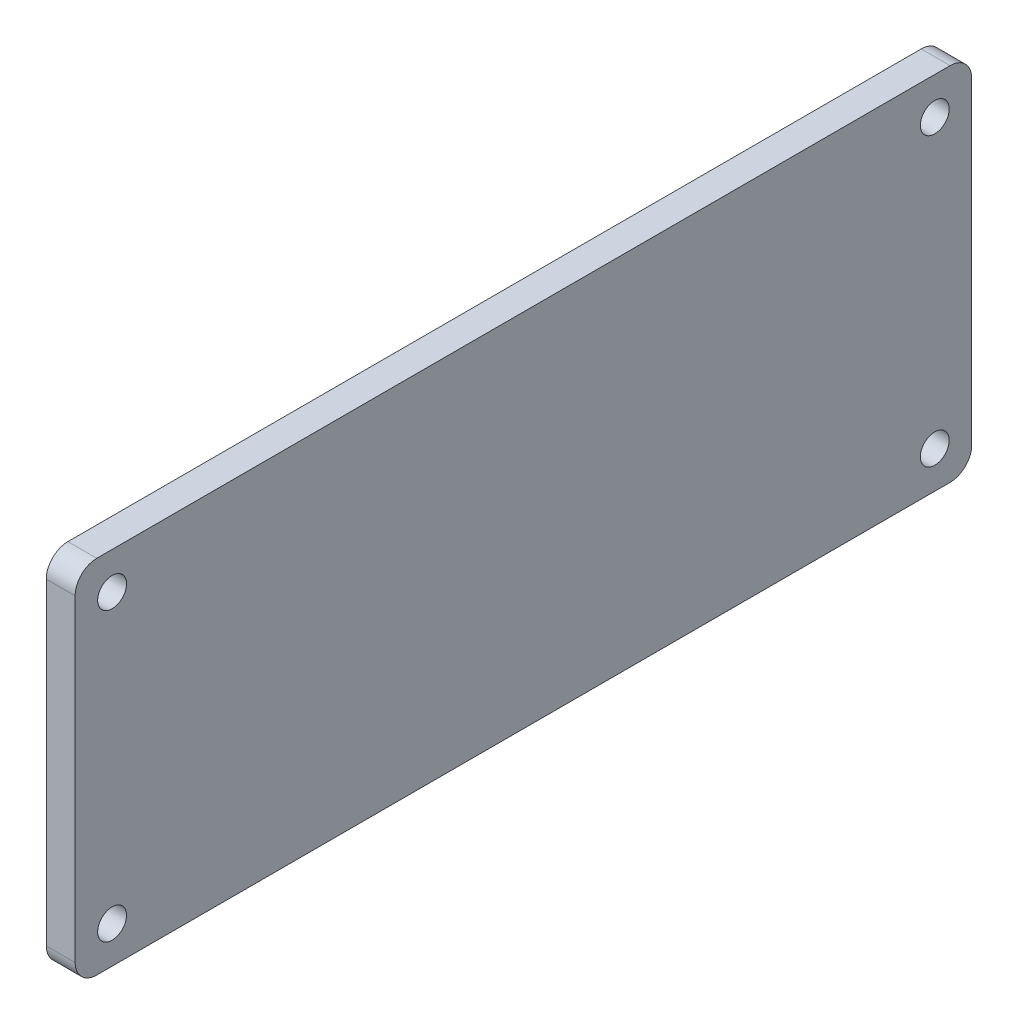
ISO-10303-21;
HEADER;
FILE_DESCRIPTION(('STEP AP214'),'2;1');
FILE_NAME('part.step','',(''),(''),'','','');
FILE_SCHEMA(('AUTOMOTIVE_DESIGN { 1 0 10303 214 1 1 1 1 }'));
ENDSEC;
DATA;
#1=APPLICATION_CONTEXT('core data for automotive mechanical design processes');
#2=APPLICATION_PROTOCOL_DEFINITION('international standard','automotive_design',2000,#1);
#3=PRODUCT_CONTEXT('',#1,'mechanical');
#4=PRODUCT('Part','Part','',(#3));
#5=PRODUCT_RELATED_PRODUCT_CATEGORY('part','',(#4));
#6=PRODUCT_DEFINITION_FORMATION('','',#4);
#7=PRODUCT_DEFINITION_CONTEXT('part definition',#1,'design');
#8=PRODUCT_DEFINITION('design','',#6,#7);
#9=PRODUCT_DEFINITION_SHAPE('','',#8);
#10=(LENGTH_UNIT() NAMED_UNIT(*) SI_UNIT(.MILLI.,.METRE.));
#11=(NAMED_UNIT(*) PLANE_ANGLE_UNIT() SI_UNIT($,.RADIAN.));
#12=(NAMED_UNIT(*) SI_UNIT($,.STERADIAN.) SOLID_ANGLE_UNIT());
#13=UNCERTAINTY_MEASURE_WITH_UNIT(LENGTH_MEASURE(1.E-05),#10,'distance_accuracy_value','');
#14=(GEOMETRIC_REPRESENTATION_CONTEXT(3) GLOBAL_UNCERTAINTY_ASSIGNED_CONTEXT((#13)) GLOBAL_UNIT_ASSIGNED_CONTEXT((#10,
#11,#12)) REPRESENTATION_CONTEXT('',''));
#15=CARTESIAN_POINT('',(0.,0.,0.));
#16=DIRECTION('',(0.,0.,1.));
#17=DIRECTION('',(1.,0.,0.));
#18=AXIS2_PLACEMENT_3D('',#15,#16,#17);
#19=CARTESIAN_POINT('',(2.,11.,29.55));
#20=DIRECTION('',(-1.,0.,0.));
#21=DIRECTION('',(0.,0.,1.));
#22=AXIS2_PLACEMENT_3D('',#19,#20,#21);
#23=PLANE('',#22);
#24=CARTESIAN_POINT('',(2.,-9.93933982822018,-28.4893398282202));
#25=DIRECTION('',(-1.,0.,0.));
#26=DIRECTION('',(0.,0.,1.));
#27=AXIS2_PLACEMENT_3D('',#24,#25,#26);
#28=CIRCLE('',#27,1.);
#29=CARTESIAN_POINT('',(2.,-9.93933982822018,-27.4893398282202));
#30=VERTEX_POINT('',#29);
#31=EDGE_CURVE('E323',#30,#30,#28,.T.);
#32=ORIENTED_EDGE('',*,*,#31,.T.);
#33=EDGE_LOOP('',(#32));
#34=FACE_BOUND('',#33,.T.);
#35=CARTESIAN_POINT('',(2.,9.93933982822018,28.4893398282202));
#36=DIRECTION('',(-1.,0.,0.));
#37=DIRECTION('',(0.,0.,1.));
#38=AXIS2_PLACEMENT_3D('',#35,#36,#37);
#39=CIRCLE('',#38,1.);
#40=CARTESIAN_POINT('',(2.,9.93933982822018,29.4893398282202));
#41=VERTEX_POINT('',#40);
#42=EDGE_CURVE('E245',#41,#41,#39,.T.);
#43=ORIENTED_EDGE('',*,*,#42,.T.);
#44=EDGE_LOOP('',(#43));
#45=FACE_BOUND('',#44,.T.);
#46=CARTESIAN_POINT('',(2.,11.,29.55));
#47=DIRECTION('',(-1.,0.,0.));
#48=DIRECTION('',(0.,0.,1.));
#49=AXIS2_PLACEMENT_3D('',#46,#47,#48);
#50=CIRCLE('',#49,1.5);
#51=CARTESIAN_POINT('',(2.,11.,31.05));
#52=VERTEX_POINT('',#51);
#53=CARTESIAN_POINT('',(2.,12.5,29.55));
#54=VERTEX_POINT('',#53);
#55=EDGE_CURVE('E261',#52,#54,#50,.T.);
#56=ORIENTED_EDGE('',*,*,#55,.F.);
#57=DIRECTION('',(0.,1.,0.));
#58=VECTOR('',#57,1.);
#59=CARTESIAN_POINT('',(2.,-11.,31.05));
#60=LINE('',#59,#58);
#61=CARTESIAN_POINT('',(2.,-11.,31.05));
#62=VERTEX_POINT('',#61);
#63=EDGE_CURVE('E236',#62,#52,#60,.T.);
#64=ORIENTED_EDGE('',*,*,#63,.F.);
#65=CARTESIAN_POINT('',(2.,-11.,29.55));
#66=DIRECTION('',(-1.,0.,0.));
#67=DIRECTION('',(0.,0.,1.));
#68=AXIS2_PLACEMENT_3D('',#65,#66,#67);
#69=CIRCLE('',#68,1.5);
#70=CARTESIAN_POINT('',(2.,-12.5,29.55));
#71=VERTEX_POINT('',#70);
#72=EDGE_CURVE('E220',#71,#62,#69,.T.);
#73=ORIENTED_EDGE('',*,*,#72,.F.);
#74=DIRECTION('',(0.,0.,-1.));
#75=VECTOR('',#74,1.);
#76=CARTESIAN_POINT('',(2.,-12.5,29.55));
#77=LINE('',#76,#75);
#78=CARTESIAN_POINT('',(2.,-12.5,-29.55));
#79=VERTEX_POINT('',#78);
#80=EDGE_CURVE('E228',#71,#79,#77,.T.);
#81=ORIENTED_EDGE('',*,*,#80,.T.);
#82=CARTESIAN_POINT('',(2.,-11.,-29.55));
#83=DIRECTION('',(1.,0.,0.));
#84=DIRECTION('',(0.,0.,-1.));
#85=AXIS2_PLACEMENT_3D('',#82,#83,#84);
#86=CIRCLE('',#85,1.5);
#87=CARTESIAN_POINT('',(2.,-11.,-31.05));
#88=VERTEX_POINT('',#87);
#89=EDGE_CURVE('E233',#79,#88,#86,.T.);
#90=ORIENTED_EDGE('',*,*,#89,.T.);
#91=DIRECTION('',(0.,1.,0.));
#92=VECTOR('',#91,1.);
#93=CARTESIAN_POINT('',(2.,-11.,-31.05));
#94=LINE('',#93,#92);
#95=CARTESIAN_POINT('',(2.,11.,-31.05));
#96=VERTEX_POINT('',#95);
#97=EDGE_CURVE('E344',#88,#96,#94,.T.);
#98=ORIENTED_EDGE('',*,*,#97,.T.);
#99=CARTESIAN_POINT('',(2.,11.,-29.55));
#100=DIRECTION('',(-1.,0.,0.));
#101=DIRECTION('',(0.,0.,1.));
#102=AXIS2_PLACEMENT_3D('',#99,#100,#101);
#103=CIRCLE('',#102,1.5);
#104=CARTESIAN_POINT('',(2.,12.5,-29.55));
#105=VERTEX_POINT('',#104);
#106=EDGE_CURVE('E341',#105,#96,#103,.T.);
#107=ORIENTED_EDGE('',*,*,#106,.F.);
#108=DIRECTION('',(0.,0.,-1.));
#109=VECTOR('',#108,1.);
#110=CARTESIAN_POINT('',(2.,12.5,29.55));
#111=LINE('',#110,#109);
#112=EDGE_CURVE('E339',#54,#105,#111,.T.);
#113=ORIENTED_EDGE('',*,*,#112,.F.);
#114=EDGE_LOOP('',(#56,#64,#73,#81,#90,#98,#107,#113));
#115=FACE_BOUND('',#114,.T.);
#116=CARTESIAN_POINT('',(2.,-9.93933982822018,28.4893398282202));
#117=DIRECTION('',(1.,0.,0.));
#118=DIRECTION('',(0.,0.,-1.));
#119=AXIS2_PLACEMENT_3D('',#116,#117,#118);
#120=CIRCLE('',#119,1.);
#121=CARTESIAN_POINT('',(2.,-9.93933982822018,27.4893398282202));
#122=VERTEX_POINT('',#121);
#123=EDGE_CURVE('E328',#122,#122,#120,.T.);
#124=ORIENTED_EDGE('',*,*,#123,.F.);
#125=EDGE_LOOP('',(#124));
#126=FACE_BOUND('',#125,.T.);
#127=CARTESIAN_POINT('',(2.,9.93933982822018,-28.4893398282202));
#128=DIRECTION('',(1.,0.,0.));
#129=DIRECTION('',(0.,0.,-1.));
#130=AXIS2_PLACEMENT_3D('',#127,#128,#129);
#131=CIRCLE('',#130,1.);
#132=CARTESIAN_POINT('',(2.,9.93933982822018,-29.4893398282202));
#133=VERTEX_POINT('',#132);
#134=EDGE_CURVE('E314',#133,#133,#131,.T.);
#135=ORIENTED_EDGE('',*,*,#134,.F.);
#136=EDGE_LOOP('',(#135));
#137=FACE_BOUND('',#136,.T.);
#138=ADVANCED_FACE('F146',(#34,#45,#115,#126,#137),#23,.F.);
#139=CARTESIAN_POINT('',(0.,11.,29.55));
#140=DIRECTION('',(-1.,0.,0.));
#141=DIRECTION('',(0.,0.,1.));
#142=AXIS2_PLACEMENT_3D('',#139,#140,#141);
#143=PLANE('',#142);
#144=CARTESIAN_POINT('',(0.,-9.93933982822018,28.4893398282202));
#145=DIRECTION('',(1.,0.,0.));
#146=DIRECTION('',(0.,0.,-1.));
#147=AXIS2_PLACEMENT_3D('',#144,#145,#146);
#148=CIRCLE('',#147,1.);
#149=CARTESIAN_POINT('',(0.,-9.93933982822018,27.4893398282202));
#150=VERTEX_POINT('',#149);
#151=EDGE_CURVE('E325',#150,#150,#148,.T.);
#152=ORIENTED_EDGE('',*,*,#151,.T.);
#153=EDGE_LOOP('',(#152));
#154=FACE_BOUND('',#153,.T.);
#155=CARTESIAN_POINT('',(0.,9.93933982822018,28.4893398282202));
#156=DIRECTION('',(-1.,0.,0.));
#157=DIRECTION('',(0.,0.,1.));
#158=AXIS2_PLACEMENT_3D('',#155,#156,#157);
#159=CIRCLE('',#158,1.);
#160=CARTESIAN_POINT('',(0.,9.93933982822018,29.4893398282202));
#161=VERTEX_POINT('',#160);
#162=EDGE_CURVE('E331',#161,#161,#159,.T.);
#163=ORIENTED_EDGE('',*,*,#162,.F.);
#164=EDGE_LOOP('',(#163));
#165=FACE_BOUND('',#164,.T.);
#166=CARTESIAN_POINT('',(0.,11.,29.55));
#167=DIRECTION('',(-1.,0.,0.));
#168=DIRECTION('',(0.,0.,1.));
#169=AXIS2_PLACEMENT_3D('',#166,#167,#168);
#170=CIRCLE('',#169,1.5);
#171=CARTESIAN_POINT('',(0.,11.,31.05));
#172=VERTEX_POINT('',#171);
#173=CARTESIAN_POINT('',(0.,12.5,29.55));
#174=VERTEX_POINT('',#173);
#175=EDGE_CURVE('E241',#172,#174,#170,.T.);
#176=ORIENTED_EDGE('',*,*,#175,.T.);
#177=DIRECTION('',(0.,0.,-1.));
#178=VECTOR('',#177,1.);
#179=CARTESIAN_POINT('',(0.,12.5,29.55));
#180=LINE('',#179,#178);
#181=CARTESIAN_POINT('',(0.,12.5,-29.55));
#182=VERTEX_POINT('',#181);
#183=EDGE_CURVE('E244',#174,#182,#180,.T.);
#184=ORIENTED_EDGE('',*,*,#183,.T.);
#185=CARTESIAN_POINT('',(0.,11.,-29.55));
#186=DIRECTION('',(-1.,0.,0.));
#187=DIRECTION('',(0.,0.,1.));
#188=AXIS2_PLACEMENT_3D('',#185,#186,#187);
#189=CIRCLE('',#188,1.5);
#190=CARTESIAN_POINT('',(0.,11.,-31.05));
#191=VERTEX_POINT('',#190);
#192=EDGE_CURVE('E248',#182,#191,#189,.T.);
#193=ORIENTED_EDGE('',*,*,#192,.T.);
#194=DIRECTION('',(0.,1.,0.));
#195=VECTOR('',#194,1.);
#196=CARTESIAN_POINT('',(0.,-11.,-31.05));
#197=LINE('',#196,#195);
#198=CARTESIAN_POINT('',(0.,-11.,-31.05));
#199=VERTEX_POINT('',#198);
#200=EDGE_CURVE('E251',#199,#191,#197,.T.);
#201=ORIENTED_EDGE('',*,*,#200,.F.);
#202=CARTESIAN_POINT('',(0.,-11.,-29.55));
#203=DIRECTION('',(1.,0.,0.));
#204=DIRECTION('',(0.,0.,-1.));
#205=AXIS2_PLACEMENT_3D('',#202,#203,#204);
#206=CIRCLE('',#205,1.5);
#207=CARTESIAN_POINT('',(0.,-12.5,-29.55));
#208=VERTEX_POINT('',#207);
#209=EDGE_CURVE('E254',#208,#199,#206,.T.);
#210=ORIENTED_EDGE('',*,*,#209,.F.);
#211=DIRECTION('',(0.,0.,-1.));
#212=VECTOR('',#211,1.);
#213=CARTESIAN_POINT('',(0.,-12.5,29.55));
#214=LINE('',#213,#212);
#215=CARTESIAN_POINT('',(0.,-12.5,29.55));
#216=VERTEX_POINT('',#215);
#217=EDGE_CURVE('E256',#216,#208,#214,.T.);
#218=ORIENTED_EDGE('',*,*,#217,.F.);
#219=CARTESIAN_POINT('',(0.,-11.,29.55));
#220=DIRECTION('',(-1.,0.,0.));
#221=DIRECTION('',(0.,0.,1.));
#222=AXIS2_PLACEMENT_3D('',#219,#220,#221);
#223=CIRCLE('',#222,1.5);
#224=CARTESIAN_POINT('',(0.,-11.,31.05));
#225=VERTEX_POINT('',#224);
#226=EDGE_CURVE('E222',#216,#225,#223,.T.);
#227=ORIENTED_EDGE('',*,*,#226,.T.);
#228=DIRECTION('',(0.,1.,0.));
#229=VECTOR('',#228,1.);
#230=CARTESIAN_POINT('',(0.,-11.,31.05));
#231=LINE('',#230,#229);
#232=EDGE_CURVE('E259',#225,#172,#231,.T.);
#233=ORIENTED_EDGE('',*,*,#232,.T.);
#234=EDGE_LOOP('',(#176,#184,#193,#201,#210,#218,#227,#233));
#235=FACE_BOUND('',#234,.T.);
#236=CARTESIAN_POINT('',(0.,-9.93933982822018,-28.4893398282202));
#237=DIRECTION('',(-1.,0.,0.));
#238=DIRECTION('',(0.,0.,1.));
#239=AXIS2_PLACEMENT_3D('',#236,#237,#238);
#240=CIRCLE('',#239,1.);
#241=CARTESIAN_POINT('',(0.,-9.93933982822018,-27.4893398282202));
#242=VERTEX_POINT('',#241);
#243=EDGE_CURVE('E320',#242,#242,#240,.T.);
#244=ORIENTED_EDGE('',*,*,#243,.F.);
#245=EDGE_LOOP('',(#244));
#246=FACE_BOUND('',#245,.T.);
#247=CARTESIAN_POINT('',(0.,9.93933982822018,-28.4893398282202));
#248=DIRECTION('',(1.,0.,0.));
#249=DIRECTION('',(0.,0.,-1.));
#250=AXIS2_PLACEMENT_3D('',#247,#248,#249);
#251=CIRCLE('',#250,1.);
#252=CARTESIAN_POINT('',(0.,9.93933982822018,-29.4893398282202));
#253=VERTEX_POINT('',#252);
#254=EDGE_CURVE('E317',#253,#253,#251,.T.);
#255=ORIENTED_EDGE('',*,*,#254,.T.);
#256=EDGE_LOOP('',(#255));
#257=FACE_BOUND('',#256,.T.);
#258=ADVANCED_FACE('F273',(#154,#165,#235,#246,#257),#143,.T.);
#259=CARTESIAN_POINT('',(2.,11.,29.55));
#260=DIRECTION('',(-1.,0.,0.));
#261=DIRECTION('',(0.,0.,1.));
#262=AXIS2_PLACEMENT_3D('',#259,#260,#261);
#263=CYLINDRICAL_SURFACE('',#262,1.5);
#264=ORIENTED_EDGE('',*,*,#175,.F.);
#265=DIRECTION('',(-1.,0.,0.));
#266=VECTOR('',#265,1.);
#267=CARTESIAN_POINT('',(2.,11.,31.05));
#268=LINE('',#267,#266);
#269=EDGE_CURVE('E12',#52,#172,#268,.T.);
#270=ORIENTED_EDGE('',*,*,#269,.F.);
#271=ORIENTED_EDGE('',*,*,#55,.T.);
#272=DIRECTION('',(-1.,0.,0.));
#273=VECTOR('',#272,1.);
#274=CARTESIAN_POINT('',(2.,12.5,29.55));
#275=LINE('',#274,#273);
#276=EDGE_CURVE('E150',#54,#174,#275,.T.);
#277=ORIENTED_EDGE('',*,*,#276,.T.);
#278=EDGE_LOOP('',(#264,#270,#271,#277));
#279=FACE_BOUND('',#278,.T.);
#280=ADVANCED_FACE('F148',(#279),#263,.T.);
#281=CARTESIAN_POINT('',(2.,-11.,31.05));
#282=DIRECTION('',(0.,0.,1.));
#283=DIRECTION('',(1.,0.,0.));
#284=AXIS2_PLACEMENT_3D('',#281,#282,#283);
#285=PLANE('',#284);
#286=ORIENTED_EDGE('',*,*,#232,.F.);
#287=DIRECTION('',(-1.,0.,0.));
#288=VECTOR('',#287,1.);
#289=CARTESIAN_POINT('',(2.,-11.,31.05));
#290=LINE('',#289,#288);
#291=EDGE_CURVE('E156',#62,#225,#290,.T.);
#292=ORIENTED_EDGE('',*,*,#291,.F.);
#293=ORIENTED_EDGE('',*,*,#63,.T.);
#294=ORIENTED_EDGE('',*,*,#269,.T.);
#295=EDGE_LOOP('',(#286,#292,#293,#294));
#296=FACE_BOUND('',#295,.T.);
#297=ADVANCED_FACE('F275',(#296),#285,.T.);
#298=CARTESIAN_POINT('',(2.,-11.,29.55));
#299=DIRECTION('',(-1.,0.,0.));
#300=DIRECTION('',(0.,0.,1.));
#301=AXIS2_PLACEMENT_3D('',#298,#299,#300);
#302=CYLINDRICAL_SURFACE('',#301,1.5);
#303=ORIENTED_EDGE('',*,*,#226,.F.);
#304=DIRECTION('',(-1.,0.,0.));
#305=VECTOR('',#304,1.);
#306=CARTESIAN_POINT('',(2.,-12.5,29.55));
#307=LINE('',#306,#305);
#308=EDGE_CURVE('E216',#71,#216,#307,.T.);
#309=ORIENTED_EDGE('',*,*,#308,.F.);
#310=ORIENTED_EDGE('',*,*,#72,.T.);
#311=ORIENTED_EDGE('',*,*,#291,.T.);
#312=EDGE_LOOP('',(#303,#309,#310,#311));
#313=FACE_BOUND('',#312,.T.);
#314=ADVANCED_FACE('F218',(#313),#302,.T.);
#315=CARTESIAN_POINT('',(2.,-12.5,29.55));
#316=DIRECTION('',(0.,1.,0.));
#317=DIRECTION('',(0.,0.,1.));
#318=AXIS2_PLACEMENT_3D('',#315,#316,#317);
#319=PLANE('',#318);
#320=ORIENTED_EDGE('',*,*,#217,.T.);
#321=DIRECTION('',(-1.,0.,0.));
#322=VECTOR('',#321,1.);
#323=CARTESIAN_POINT('',(2.,-12.5,-29.55));
#324=LINE('',#323,#322);
#325=EDGE_CURVE('E225',#79,#208,#324,.T.);
#326=ORIENTED_EDGE('',*,*,#325,.F.);
#327=ORIENTED_EDGE('',*,*,#80,.F.);
#328=ORIENTED_EDGE('',*,*,#308,.T.);
#329=EDGE_LOOP('',(#320,#326,#327,#328));
#330=FACE_BOUND('',#329,.T.);
#331=ADVANCED_FACE('F229',(#330),#319,.F.);
#332=CARTESIAN_POINT('',(2.,-11.,-29.55));
#333=DIRECTION('',(-1.,0.,0.));
#334=DIRECTION('',(0.,0.,1.));
#335=AXIS2_PLACEMENT_3D('',#332,#333,#334);
#336=CYLINDRICAL_SURFACE('',#335,1.5);
#337=ORIENTED_EDGE('',*,*,#209,.T.);
#338=DIRECTION('',(-1.,0.,0.));
#339=VECTOR('',#338,1.);
#340=CARTESIAN_POINT('',(2.,-11.,-31.05));
#341=LINE('',#340,#339);
#342=EDGE_CURVE('E265',#88,#199,#341,.T.);
#343=ORIENTED_EDGE('',*,*,#342,.F.);
#344=ORIENTED_EDGE('',*,*,#89,.F.);
#345=ORIENTED_EDGE('',*,*,#325,.T.);
#346=EDGE_LOOP('',(#337,#343,#344,#345));
#347=FACE_BOUND('',#346,.T.);
#348=ADVANCED_FACE('F350',(#347),#336,.T.);
#349=CARTESIAN_POINT('',(2.,-11.,-31.05));
#350=DIRECTION('',(0.,0.,1.));
#351=DIRECTION('',(1.,0.,0.));
#352=AXIS2_PLACEMENT_3D('',#349,#350,#351);
#353=PLANE('',#352);
#354=ORIENTED_EDGE('',*,*,#200,.T.);
#355=DIRECTION('',(-1.,0.,0.));
#356=VECTOR('',#355,1.);
#357=CARTESIAN_POINT('',(2.,11.,-31.05));
#358=LINE('',#357,#356);
#359=EDGE_CURVE('E268',#96,#191,#358,.T.);
#360=ORIENTED_EDGE('',*,*,#359,.F.);
#361=ORIENTED_EDGE('',*,*,#97,.F.);
#362=ORIENTED_EDGE('',*,*,#342,.T.);
#363=EDGE_LOOP('',(#354,#360,#361,#362));
#364=FACE_BOUND('',#363,.T.);
#365=ADVANCED_FACE('F354',(#364),#353,.F.);
#366=CARTESIAN_POINT('',(2.,11.,-29.55));
#367=DIRECTION('',(-1.,0.,0.));
#368=DIRECTION('',(0.,0.,1.));
#369=AXIS2_PLACEMENT_3D('',#366,#367,#368);
#370=CYLINDRICAL_SURFACE('',#369,1.5);
#371=ORIENTED_EDGE('',*,*,#192,.F.);
#372=DIRECTION('',(-1.,0.,0.));
#373=VECTOR('',#372,1.);
#374=CARTESIAN_POINT('',(2.,12.5,-29.55));
#375=LINE('',#374,#373);
#376=EDGE_CURVE('E269',#105,#182,#375,.T.);
#377=ORIENTED_EDGE('',*,*,#376,.F.);
#378=ORIENTED_EDGE('',*,*,#106,.T.);
#379=ORIENTED_EDGE('',*,*,#359,.T.);
#380=EDGE_LOOP('',(#371,#377,#378,#379));
#381=FACE_BOUND('',#380,.T.);
#382=ADVANCED_FACE('F356',(#381),#370,.T.);
#383=CARTESIAN_POINT('',(2.,12.5,29.55));
#384=DIRECTION('',(0.,1.,0.));
#385=DIRECTION('',(0.,0.,1.));
#386=AXIS2_PLACEMENT_3D('',#383,#384,#385);
#387=PLANE('',#386);
#388=ORIENTED_EDGE('',*,*,#183,.F.);
#389=ORIENTED_EDGE('',*,*,#276,.F.);
#390=ORIENTED_EDGE('',*,*,#112,.T.);
#391=ORIENTED_EDGE('',*,*,#376,.T.);
#392=EDGE_LOOP('',(#388,#389,#390,#391));
#393=FACE_BOUND('',#392,.T.);
#394=ADVANCED_FACE('F271',(#393),#387,.T.);
#395=CARTESIAN_POINT('',(2.,9.93933982822018,28.4893398282202));
#396=DIRECTION('',(-1.,0.,0.));
#397=DIRECTION('',(0.,0.,1.));
#398=AXIS2_PLACEMENT_3D('',#395,#396,#397);
#399=CYLINDRICAL_SURFACE('',#398,1.);
#400=ORIENTED_EDGE('',*,*,#42,.F.);
#401=EDGE_LOOP('',(#400));
#402=FACE_BOUND('',#401,.T.);
#403=ORIENTED_EDGE('',*,*,#162,.T.);
#404=EDGE_LOOP('',(#403));
#405=FACE_BOUND('',#404,.T.);
#406=ADVANCED_FACE('F294',(#402,#405),#399,.F.);
#407=CARTESIAN_POINT('',(2.,-9.93933982822018,28.4893398282202));
#408=DIRECTION('',(-1.,0.,0.));
#409=DIRECTION('',(0.,0.,1.));
#410=AXIS2_PLACEMENT_3D('',#407,#408,#409);
#411=CYLINDRICAL_SURFACE('',#410,1.);
#412=ORIENTED_EDGE('',*,*,#123,.T.);
#413=EDGE_LOOP('',(#412));
#414=FACE_BOUND('',#413,.T.);
#415=ORIENTED_EDGE('',*,*,#151,.F.);
#416=EDGE_LOOP('',(#415));
#417=FACE_BOUND('',#416,.T.);
#418=ADVANCED_FACE('F297',(#414,#417),#411,.F.);
#419=CARTESIAN_POINT('',(2.,-9.93933982822018,-28.4893398282202));
#420=DIRECTION('',(-1.,0.,0.));
#421=DIRECTION('',(0.,0.,1.));
#422=AXIS2_PLACEMENT_3D('',#419,#420,#421);
#423=CYLINDRICAL_SURFACE('',#422,1.);
#424=ORIENTED_EDGE('',*,*,#31,.F.);
#425=EDGE_LOOP('',(#424));
#426=FACE_BOUND('',#425,.T.);
#427=ORIENTED_EDGE('',*,*,#243,.T.);
#428=EDGE_LOOP('',(#427));
#429=FACE_BOUND('',#428,.T.);
#430=ADVANCED_FACE('F301',(#426,#429),#423,.F.);
#431=CARTESIAN_POINT('',(2.,9.93933982822018,-28.4893398282202));
#432=DIRECTION('',(-1.,0.,0.));
#433=DIRECTION('',(0.,0.,1.));
#434=AXIS2_PLACEMENT_3D('',#431,#432,#433);
#435=CYLINDRICAL_SURFACE('',#434,1.);
#436=ORIENTED_EDGE('',*,*,#134,.T.);
#437=EDGE_LOOP('',(#436));
#438=FACE_BOUND('',#437,.T.);
#439=ORIENTED_EDGE('',*,*,#254,.F.);
#440=EDGE_LOOP('',(#439));
#441=FACE_BOUND('',#440,.T.);
#442=ADVANCED_FACE('F305',(#438,#441),#435,.F.);
#443=CLOSED_SHELL('',(#138,#258,#280,#297,#314,#331,#348,#365,#382,#394,#406,#418,#430,#442));
#444=MANIFOLD_SOLID_BREP('B2',#443);
#445=ADVANCED_BREP_SHAPE_REPRESENTATION('',(#18,#444),#14);
#446=SHAPE_DEFINITION_REPRESENTATION(#9,#445);
ENDSEC;
END-ISO-10303-21;
